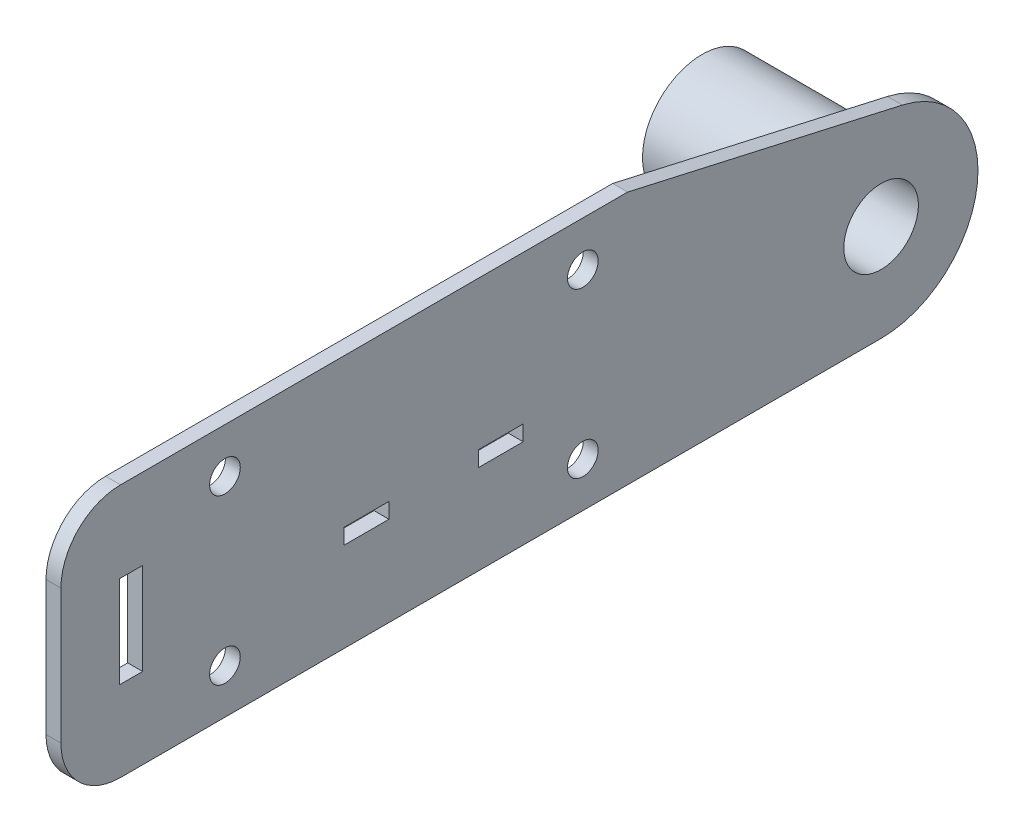
ISO-10303-21;
HEADER;
FILE_DESCRIPTION(('STEP AP214'),'2;1');
FILE_NAME('part.step','',(''),(''),'','','');
FILE_SCHEMA(('AUTOMOTIVE_DESIGN { 1 0 10303 214 1 1 1 1 }'));
ENDSEC;
DATA;
#1=APPLICATION_CONTEXT('core data for automotive mechanical design processes');
#2=APPLICATION_PROTOCOL_DEFINITION('international standard','automotive_design',2000,#1);
#3=PRODUCT_CONTEXT('',#1,'mechanical');
#4=PRODUCT('Part','Part','',(#3));
#5=PRODUCT_RELATED_PRODUCT_CATEGORY('part','',(#4));
#6=PRODUCT_DEFINITION_FORMATION('','',#4);
#7=PRODUCT_DEFINITION_CONTEXT('part definition',#1,'design');
#8=PRODUCT_DEFINITION('design','',#6,#7);
#9=PRODUCT_DEFINITION_SHAPE('','',#8);
#10=(LENGTH_UNIT() NAMED_UNIT(*) SI_UNIT(.MILLI.,.METRE.));
#11=(NAMED_UNIT(*) PLANE_ANGLE_UNIT() SI_UNIT($,.RADIAN.));
#12=(NAMED_UNIT(*) SI_UNIT($,.STERADIAN.) SOLID_ANGLE_UNIT());
#13=UNCERTAINTY_MEASURE_WITH_UNIT(LENGTH_MEASURE(1.E-05),#10,'distance_accuracy_value','');
#14=(GEOMETRIC_REPRESENTATION_CONTEXT(3) GLOBAL_UNCERTAINTY_ASSIGNED_CONTEXT((#13)) GLOBAL_UNIT_ASSIGNED_CONTEXT((#10,
#11,#12)) REPRESENTATION_CONTEXT('',''));
#15=CARTESIAN_POINT('',(0.,0.,0.));
#16=DIRECTION('',(0.,0.,1.));
#17=DIRECTION('',(1.,0.,0.));
#18=AXIS2_PLACEMENT_3D('',#15,#16,#17);
#19=CARTESIAN_POINT('',(3.175,-26.9875,0.));
#20=DIRECTION('',(0.,1.,0.));
#21=DIRECTION('',(0.,0.,1.));
#22=AXIS2_PLACEMENT_3D('',#19,#20,#21);
#23=PLANE('',#22);
#24=DIRECTION('',(0.,0.,-1.));
#25=VECTOR('',#24,1.);
#26=CARTESIAN_POINT('',(0.,-26.9875,0.));
#27=LINE('',#26,#25);
#28=CARTESIAN_POINT('',(0.,-26.9875,60.3249999999999));
#29=VERTEX_POINT('',#28);
#30=CARTESIAN_POINT('',(0.,-26.9875,-101.6));
#31=VERTEX_POINT('',#30);
#32=EDGE_CURVE('E324',#29,#31,#27,.T.);
#33=ORIENTED_EDGE('',*,*,#32,.T.);
#34=DIRECTION('',(-1.,0.,0.));
#35=VECTOR('',#34,1.);
#36=CARTESIAN_POINT('',(3.175,-26.9875,-101.6));
#37=LINE('',#36,#35);
#38=CARTESIAN_POINT('',(3.175,-26.9875,-101.6));
#39=VERTEX_POINT('',#38);
#40=EDGE_CURVE('E338',#39,#31,#37,.T.);
#41=ORIENTED_EDGE('',*,*,#40,.F.);
#42=DIRECTION('',(0.,0.,-1.));
#43=VECTOR('',#42,1.);
#44=CARTESIAN_POINT('',(3.175,-26.9875,0.));
#45=LINE('',#44,#43);
#46=CARTESIAN_POINT('',(3.175,-26.9875,60.3249999999999));
#47=VERTEX_POINT('',#46);
#48=EDGE_CURVE('E301',#47,#39,#45,.T.);
#49=ORIENTED_EDGE('',*,*,#48,.F.);
#50=DIRECTION('',(1.,0.,0.));
#51=VECTOR('',#50,1.);
#52=CARTESIAN_POINT('',(-59.6528341740776,-26.9875,60.3249999999999));
#53=LINE('',#52,#51);
#54=EDGE_CURVE('E265',#29,#47,#53,.T.);
#55=ORIENTED_EDGE('',*,*,#54,.F.);
#56=EDGE_LOOP('',(#33,#41,#49,#55));
#57=FACE_BOUND('',#56,.T.);
#58=ADVANCED_FACE('F38',(#57),#23,.F.);
#59=CARTESIAN_POINT('',(3.175,-6.35,-101.6));
#60=DIRECTION('',(-1.,0.,0.));
#61=DIRECTION('',(0.,0.,1.));
#62=AXIS2_PLACEMENT_3D('',#59,#60,#61);
#63=CYLINDRICAL_SURFACE('',#62,20.6375);
#64=CARTESIAN_POINT('',(0.,-6.35,-101.6));
#65=DIRECTION('',(1.,0.,0.));
#66=DIRECTION('',(0.,0.,-1.));
#67=AXIS2_PLACEMENT_3D('',#64,#65,#66);
#68=CIRCLE('',#67,20.6375);
#69=CARTESIAN_POINT('',(0.,13.7812178866127,-106.143178694673));
#70=VERTEX_POINT('',#69);
#71=EDGE_CURVE('E327',#31,#70,#68,.T.);
#72=ORIENTED_EDGE('',*,*,#71,.T.);
#73=DIRECTION('',(-1.,0.,0.));
#74=VECTOR('',#73,1.);
#75=CARTESIAN_POINT('',(3.175,13.7812178866127,-106.143178694673));
#76=LINE('',#75,#74);
#77=CARTESIAN_POINT('',(3.175,13.7812178866127,-106.143178694673));
#78=VERTEX_POINT('',#77);
#79=EDGE_CURVE('E336',#78,#70,#76,.T.);
#80=ORIENTED_EDGE('',*,*,#79,.F.);
#81=CARTESIAN_POINT('',(3.175,-6.35,-101.6));
#82=DIRECTION('',(1.,0.,0.));
#83=DIRECTION('',(0.,0.,-1.));
#84=AXIS2_PLACEMENT_3D('',#81,#82,#83);
#85=CIRCLE('',#84,20.6375);
#86=EDGE_CURVE('E304',#39,#78,#85,.T.);
#87=ORIENTED_EDGE('',*,*,#86,.F.);
#88=ORIENTED_EDGE('',*,*,#40,.T.);
#89=EDGE_LOOP('',(#72,#80,#87,#88));
#90=FACE_BOUND('',#89,.T.);
#91=ADVANCED_FACE('F377',(#90),#63,.T.);
#92=CARTESIAN_POINT('',(3.175,35.9066765211899,-8.10335711859988));
#93=DIRECTION('',(0.,0.97546785640764,-0.220141911310601));
#94=DIRECTION('',(0.,0.220141911310601,0.97546785640764));
#95=AXIS2_PLACEMENT_3D('',#92,#93,#94);
#96=PLANE('',#95);
#97=DIRECTION('',(0.,-0.220141911310601,-0.97546785640764));
#98=VECTOR('',#97,1.);
#99=CARTESIAN_POINT('',(0.,35.9066765211899,-8.10335711859988));
#100=LINE('',#99,#98);
#101=CARTESIAN_POINT('',(0.,26.9875,-47.625));
#102=VERTEX_POINT('',#101);
#103=EDGE_CURVE('E330',#102,#70,#100,.T.);
#104=ORIENTED_EDGE('',*,*,#103,.F.);
#105=DIRECTION('',(-1.,0.,0.));
#106=VECTOR('',#105,1.);
#107=CARTESIAN_POINT('',(3.175,26.9875,-47.625));
#108=LINE('',#107,#106);
#109=CARTESIAN_POINT('',(3.175,26.9875,-47.625));
#110=VERTEX_POINT('',#109);
#111=EDGE_CURVE('E312',#110,#102,#108,.T.);
#112=ORIENTED_EDGE('',*,*,#111,.F.);
#113=DIRECTION('',(0.,-0.220141911310601,-0.97546785640764));
#114=VECTOR('',#113,1.);
#115=CARTESIAN_POINT('',(3.175,35.9066765211899,-8.10335711859988));
#116=LINE('',#115,#114);
#117=EDGE_CURVE('E306',#110,#78,#116,.T.);
#118=ORIENTED_EDGE('',*,*,#117,.T.);
#119=ORIENTED_EDGE('',*,*,#79,.T.);
#120=EDGE_LOOP('',(#104,#112,#118,#119));
#121=FACE_BOUND('',#120,.T.);
#122=ADVANCED_FACE('F383',(#121),#96,.T.);
#123=CARTESIAN_POINT('',(3.175,26.9875,0.));
#124=DIRECTION('',(0.,1.,0.));
#125=DIRECTION('',(0.,0.,1.));
#126=AXIS2_PLACEMENT_3D('',#123,#124,#125);
#127=PLANE('',#126);
#128=DIRECTION('',(0.,0.,-1.));
#129=VECTOR('',#128,1.);
#130=CARTESIAN_POINT('',(0.,26.9875,0.));
#131=LINE('',#130,#129);
#132=CARTESIAN_POINT('',(0.,26.9875,60.3249999999999));
#133=VERTEX_POINT('',#132);
#134=EDGE_CURVE('E292',#133,#102,#131,.T.);
#135=ORIENTED_EDGE('',*,*,#134,.F.);
#136=DIRECTION('',(1.,0.,0.));
#137=VECTOR('',#136,1.);
#138=CARTESIAN_POINT('',(-59.6528341740776,26.9875,60.3249999999999));
#139=LINE('',#138,#137);
#140=CARTESIAN_POINT('',(3.175,26.9875,60.3249999999999));
#141=VERTEX_POINT('',#140);
#142=EDGE_CURVE('E264',#133,#141,#139,.T.);
#143=ORIENTED_EDGE('',*,*,#142,.T.);
#144=DIRECTION('',(0.,0.,-1.));
#145=VECTOR('',#144,1.);
#146=CARTESIAN_POINT('',(3.175,26.9875,0.));
#147=LINE('',#146,#145);
#148=EDGE_CURVE('E309',#141,#110,#147,.T.);
#149=ORIENTED_EDGE('',*,*,#148,.T.);
#150=ORIENTED_EDGE('',*,*,#111,.T.);
#151=EDGE_LOOP('',(#135,#143,#149,#150));
#152=FACE_BOUND('',#151,.T.);
#153=ADVANCED_FACE('F392',(#152),#127,.T.);
#154=CARTESIAN_POINT('',(3.175,17.4625,38.1));
#155=DIRECTION('',(-1.,0.,0.));
#156=DIRECTION('',(0.,0.,1.));
#157=AXIS2_PLACEMENT_3D('',#154,#155,#156);
#158=CYLINDRICAL_SURFACE('',#157,3.2639);
#159=CARTESIAN_POINT('',(3.175,17.4625,38.1));
#160=DIRECTION('',(1.,0.,0.));
#161=DIRECTION('',(0.,0.,-1.));
#162=AXIS2_PLACEMENT_3D('',#159,#160,#161);
#163=CIRCLE('',#162,3.2639);
#164=CARTESIAN_POINT('',(3.175,17.4625,34.8361));
#165=VERTEX_POINT('',#164);
#166=EDGE_CURVE('E298',#165,#165,#163,.T.);
#167=ORIENTED_EDGE('',*,*,#166,.T.);
#168=EDGE_LOOP('',(#167));
#169=FACE_BOUND('',#168,.T.);
#170=CARTESIAN_POINT('',(0.,17.4625,38.1));
#171=DIRECTION('',(1.,0.,0.));
#172=DIRECTION('',(0.,0.,-1.));
#173=AXIS2_PLACEMENT_3D('',#170,#171,#172);
#174=CIRCLE('',#173,3.2639);
#175=CARTESIAN_POINT('',(0.,17.4625,34.8361));
#176=VERTEX_POINT('',#175);
#177=EDGE_CURVE('E321',#176,#176,#174,.T.);
#178=ORIENTED_EDGE('',*,*,#177,.F.);
#179=EDGE_LOOP('',(#178));
#180=FACE_BOUND('',#179,.T.);
#181=ADVANCED_FACE('F388',(#169,#180),#158,.F.);
#182=CARTESIAN_POINT('',(3.175,17.4625,-38.1));
#183=DIRECTION('',(-1.,0.,0.));
#184=DIRECTION('',(0.,0.,1.));
#185=AXIS2_PLACEMENT_3D('',#182,#183,#184);
#186=CYLINDRICAL_SURFACE('',#185,3.2639);
#187=CARTESIAN_POINT('',(3.175,17.4625,-38.1));
#188=DIRECTION('',(1.,0.,0.));
#189=DIRECTION('',(0.,0.,-1.));
#190=AXIS2_PLACEMENT_3D('',#187,#188,#189);
#191=CIRCLE('',#190,3.2639);
#192=CARTESIAN_POINT('',(3.175,17.4625,-41.3639));
#193=VERTEX_POINT('',#192);
#194=EDGE_CURVE('E295',#193,#193,#191,.T.);
#195=ORIENTED_EDGE('',*,*,#194,.T.);
#196=EDGE_LOOP('',(#195));
#197=FACE_BOUND('',#196,.T.);
#198=CARTESIAN_POINT('',(0.,17.4625,-38.1));
#199=DIRECTION('',(1.,0.,0.));
#200=DIRECTION('',(0.,0.,-1.));
#201=AXIS2_PLACEMENT_3D('',#198,#199,#200);
#202=CIRCLE('',#201,3.2639);
#203=CARTESIAN_POINT('',(0.,17.4625,-41.3639));
#204=VERTEX_POINT('',#203);
#205=EDGE_CURVE('E318',#204,#204,#202,.T.);
#206=ORIENTED_EDGE('',*,*,#205,.F.);
#207=EDGE_LOOP('',(#206));
#208=FACE_BOUND('',#207,.T.);
#209=ADVANCED_FACE('F391',(#197,#208),#186,.F.);
#210=CARTESIAN_POINT('',(3.175,-17.4625,38.1));
#211=DIRECTION('',(-1.,0.,0.));
#212=DIRECTION('',(0.,0.,1.));
#213=AXIS2_PLACEMENT_3D('',#210,#211,#212);
#214=CYLINDRICAL_SURFACE('',#213,3.2639);
#215=CARTESIAN_POINT('',(3.175,-17.4625,38.1));
#216=DIRECTION('',(1.,0.,0.));
#217=DIRECTION('',(0.,0.,-1.));
#218=AXIS2_PLACEMENT_3D('',#215,#216,#217);
#219=CIRCLE('',#218,3.2639);
#220=CARTESIAN_POINT('',(3.175,-17.4625,34.8361));
#221=VERTEX_POINT('',#220);
#222=EDGE_CURVE('E291',#221,#221,#219,.T.);
#223=ORIENTED_EDGE('',*,*,#222,.T.);
#224=EDGE_LOOP('',(#223));
#225=FACE_BOUND('',#224,.T.);
#226=CARTESIAN_POINT('',(0.,-17.4625,38.1));
#227=DIRECTION('',(1.,0.,0.));
#228=DIRECTION('',(0.,0.,-1.));
#229=AXIS2_PLACEMENT_3D('',#226,#227,#228);
#230=CIRCLE('',#229,3.2639);
#231=CARTESIAN_POINT('',(0.,-17.4625,34.8361));
#232=VERTEX_POINT('',#231);
#233=EDGE_CURVE('E315',#232,#232,#230,.T.);
#234=ORIENTED_EDGE('',*,*,#233,.F.);
#235=EDGE_LOOP('',(#234));
#236=FACE_BOUND('',#235,.T.);
#237=ADVANCED_FACE('F395',(#225,#236),#214,.F.);
#238=CARTESIAN_POINT('',(3.175,-17.4625,-38.1));
#239=DIRECTION('',(-1.,0.,0.));
#240=DIRECTION('',(0.,0.,1.));
#241=AXIS2_PLACEMENT_3D('',#238,#239,#240);
#242=CYLINDRICAL_SURFACE('',#241,3.2639);
#243=CARTESIAN_POINT('',(3.175,-17.4625,-38.1));
#244=DIRECTION('',(1.,0.,0.));
#245=DIRECTION('',(0.,0.,-1.));
#246=AXIS2_PLACEMENT_3D('',#243,#244,#245);
#247=CIRCLE('',#246,3.2639);
#248=CARTESIAN_POINT('',(3.175,-17.4625,-41.3639));
#249=VERTEX_POINT('',#248);
#250=EDGE_CURVE('E288',#249,#249,#247,.T.);
#251=ORIENTED_EDGE('',*,*,#250,.T.);
#252=EDGE_LOOP('',(#251));
#253=FACE_BOUND('',#252,.T.);
#254=CARTESIAN_POINT('',(0.,-17.4625,-38.1));
#255=DIRECTION('',(1.,0.,0.));
#256=DIRECTION('',(0.,0.,-1.));
#257=AXIS2_PLACEMENT_3D('',#254,#255,#256);
#258=CIRCLE('',#257,3.2639);
#259=CARTESIAN_POINT('',(0.,-17.4625,-41.3639));
#260=VERTEX_POINT('',#259);
#261=EDGE_CURVE('E287',#260,#260,#258,.T.);
#262=ORIENTED_EDGE('',*,*,#261,.F.);
#263=EDGE_LOOP('',(#262));
#264=FACE_BOUND('',#263,.T.);
#265=ADVANCED_FACE('F40',(#253,#264),#242,.F.);
#266=CARTESIAN_POINT('',(3.175,0.,0.));
#267=DIRECTION('',(1.,0.,0.));
#268=DIRECTION('',(0.,0.,-1.));
#269=AXIS2_PLACEMENT_3D('',#266,#267,#268);
#270=PLANE('',#269);
#271=DIRECTION('',(0.,-1.,0.));
#272=VECTOR('',#271,1.);
#273=CARTESIAN_POINT('',(3.175,-4.6355,12.7));
#274=LINE('',#273,#272);
#275=CARTESIAN_POINT('',(3.175,-4.6355,12.7));
#276=VERTEX_POINT('',#275);
#277=CARTESIAN_POINT('',(3.175,-7.9375,12.7));
#278=VERTEX_POINT('',#277);
#279=EDGE_CURVE('E53',#276,#278,#274,.T.);
#280=ORIENTED_EDGE('',*,*,#279,.F.);
#281=DIRECTION('',(0.,0.,1.));
#282=VECTOR('',#281,1.);
#283=CARTESIAN_POINT('',(3.175,-4.6355,12.7));
#284=LINE('',#283,#282);
#285=CARTESIAN_POINT('',(3.175,-4.6355,3.175));
#286=VERTEX_POINT('',#285);
#287=EDGE_CURVE('E188',#286,#276,#284,.T.);
#288=ORIENTED_EDGE('',*,*,#287,.F.);
#289=DIRECTION('',(0.,1.,0.));
#290=VECTOR('',#289,1.);
#291=CARTESIAN_POINT('',(3.175,-4.6355,3.175));
#292=LINE('',#291,#290);
#293=CARTESIAN_POINT('',(3.175,-7.9375,3.175));
#294=VERTEX_POINT('',#293);
#295=EDGE_CURVE('E172',#294,#286,#292,.T.);
#296=ORIENTED_EDGE('',*,*,#295,.F.);
#297=DIRECTION('',(0.,0.,-1.));
#298=VECTOR('',#297,1.);
#299=CARTESIAN_POINT('',(3.175,-7.9375,12.7));
#300=LINE('',#299,#298);
#301=EDGE_CURVE('E181',#278,#294,#300,.T.);
#302=ORIENTED_EDGE('',*,*,#301,.F.);
#303=EDGE_LOOP('',(#280,#288,#296,#302));
#304=FACE_BOUND('',#303,.T.);
#305=DIRECTION('',(0.,-1.,0.));
#306=VECTOR('',#305,1.);
#307=CARTESIAN_POINT('',(3.175,-4.6355,-15.875));
#308=LINE('',#307,#306);
#309=CARTESIAN_POINT('',(3.175,-4.6355,-15.875));
#310=VERTEX_POINT('',#309);
#311=CARTESIAN_POINT('',(3.175,-7.9375,-15.875));
#312=VERTEX_POINT('',#311);
#313=EDGE_CURVE('E195',#310,#312,#308,.T.);
#314=ORIENTED_EDGE('',*,*,#313,.F.);
#315=DIRECTION('',(0.,0.,1.));
#316=VECTOR('',#315,1.);
#317=CARTESIAN_POINT('',(3.175,-4.6355,-15.875));
#318=LINE('',#317,#316);
#319=CARTESIAN_POINT('',(3.175,-4.6355,-25.4));
#320=VERTEX_POINT('',#319);
#321=EDGE_CURVE('E205',#320,#310,#318,.T.);
#322=ORIENTED_EDGE('',*,*,#321,.F.);
#323=DIRECTION('',(0.,1.,0.));
#324=VECTOR('',#323,1.);
#325=CARTESIAN_POINT('',(3.175,-4.6355,-25.4));
#326=LINE('',#325,#324);
#327=CARTESIAN_POINT('',(3.175,-7.9375,-25.4));
#328=VERTEX_POINT('',#327);
#329=EDGE_CURVE('E202',#328,#320,#326,.T.);
#330=ORIENTED_EDGE('',*,*,#329,.F.);
#331=DIRECTION('',(0.,0.,-1.));
#332=VECTOR('',#331,1.);
#333=CARTESIAN_POINT('',(3.175,-7.9375,-15.875));
#334=LINE('',#333,#332);
#335=EDGE_CURVE('E199',#312,#328,#334,.T.);
#336=ORIENTED_EDGE('',*,*,#335,.F.);
#337=EDGE_LOOP('',(#314,#322,#330,#336));
#338=FACE_BOUND('',#337,.T.);
#339=ORIENTED_EDGE('',*,*,#250,.F.);
#340=EDGE_LOOP('',(#339));
#341=FACE_BOUND('',#340,.T.);
#342=ORIENTED_EDGE('',*,*,#222,.F.);
#343=EDGE_LOOP('',(#342));
#344=FACE_BOUND('',#343,.T.);
#345=ORIENTED_EDGE('',*,*,#194,.F.);
#346=EDGE_LOOP('',(#345));
#347=FACE_BOUND('',#346,.T.);
#348=ORIENTED_EDGE('',*,*,#166,.F.);
#349=EDGE_LOOP('',(#348));
#350=FACE_BOUND('',#349,.T.);
#351=ORIENTED_EDGE('',*,*,#48,.T.);
#352=ORIENTED_EDGE('',*,*,#86,.T.);
#353=ORIENTED_EDGE('',*,*,#117,.F.);
#354=ORIENTED_EDGE('',*,*,#148,.F.);
#355=CARTESIAN_POINT('',(3.175,14.2875,60.325));
#356=DIRECTION('',(1.,0.,0.));
#357=DIRECTION('',(0.,0.,-1.));
#358=AXIS2_PLACEMENT_3D('',#355,#356,#357);
#359=CIRCLE('',#358,12.7);
#360=CARTESIAN_POINT('',(3.175,14.2874999999999,73.025));
#361=VERTEX_POINT('',#360);
#362=EDGE_CURVE('E250',#141,#361,#359,.T.);
#363=ORIENTED_EDGE('',*,*,#362,.T.);
#364=DIRECTION('',(0.,-1.,0.));
#365=VECTOR('',#364,1.);
#366=CARTESIAN_POINT('',(3.175,14.2874999999999,73.025));
#367=LINE('',#366,#365);
#368=CARTESIAN_POINT('',(3.175,-14.2874999999999,73.025));
#369=VERTEX_POINT('',#368);
#370=EDGE_CURVE('E258',#361,#369,#367,.T.);
#371=ORIENTED_EDGE('',*,*,#370,.T.);
#372=CARTESIAN_POINT('',(3.175,-14.2875,60.325));
#373=DIRECTION('',(1.,0.,0.));
#374=DIRECTION('',(0.,0.,1.));
#375=AXIS2_PLACEMENT_3D('',#372,#373,#374);
#376=CIRCLE('',#375,12.7);
#377=EDGE_CURVE('E261',#369,#47,#376,.T.);
#378=ORIENTED_EDGE('',*,*,#377,.T.);
#379=EDGE_LOOP('',(#351,#352,#353,#354,#363,#371,#378));
#380=FACE_BOUND('',#379,.T.);
#381=CARTESIAN_POINT('',(3.175,-6.35,-101.6));
#382=DIRECTION('',(-1.,0.,0.));
#383=DIRECTION('',(0.,0.,1.));
#384=AXIS2_PLACEMENT_3D('',#381,#382,#383);
#385=CIRCLE('',#384,7.93749999999999);
#386=CARTESIAN_POINT('',(3.175,-6.35,-93.6625));
#387=VERTEX_POINT('',#386);
#388=EDGE_CURVE('E281',#387,#387,#385,.T.);
#389=ORIENTED_EDGE('',*,*,#388,.T.);
#390=EDGE_LOOP('',(#389));
#391=FACE_BOUND('',#390,.T.);
#392=DIRECTION('',(0.,0.,-1.));
#393=VECTOR('',#392,1.);
#394=CARTESIAN_POINT('',(3.175,-9.77900000000001,60.579));
#395=LINE('',#394,#393);
#396=CARTESIAN_POINT('',(3.175,-9.77900000000001,60.579));
#397=VERTEX_POINT('',#396);
#398=CARTESIAN_POINT('',(3.175,-9.77900000000001,55.626));
#399=VERTEX_POINT('',#398);
#400=EDGE_CURVE('E238',#397,#399,#395,.T.);
#401=ORIENTED_EDGE('',*,*,#400,.F.);
#402=DIRECTION('',(0.,-1.,0.));
#403=VECTOR('',#402,1.);
#404=CARTESIAN_POINT('',(3.175,9.77899999999999,60.579));
#405=LINE('',#404,#403);
#406=CARTESIAN_POINT('',(3.175,9.77899999999999,60.579));
#407=VERTEX_POINT('',#406);
#408=EDGE_CURVE('E211',#407,#397,#405,.T.);
#409=ORIENTED_EDGE('',*,*,#408,.F.);
#410=DIRECTION('',(0.,0.,1.));
#411=VECTOR('',#410,1.);
#412=CARTESIAN_POINT('',(3.175,9.77899999999999,60.579));
#413=LINE('',#412,#411);
#414=CARTESIAN_POINT('',(3.175,9.77899999999999,55.626));
#415=VERTEX_POINT('',#414);
#416=EDGE_CURVE('E244',#415,#407,#413,.T.);
#417=ORIENTED_EDGE('',*,*,#416,.F.);
#418=DIRECTION('',(0.,1.,0.));
#419=VECTOR('',#418,1.);
#420=CARTESIAN_POINT('',(3.175,9.77899999999999,55.626));
#421=LINE('',#420,#419);
#422=EDGE_CURVE('E241',#399,#415,#421,.T.);
#423=ORIENTED_EDGE('',*,*,#422,.F.);
#424=EDGE_LOOP('',(#401,#409,#417,#423));
#425=FACE_BOUND('',#424,.T.);
#426=ADVANCED_FACE('F185',(#304,#338,#341,#344,#347,#350,#380,#391,#425),#270,.T.);
#427=CARTESIAN_POINT('',(0.,0.,0.));
#428=DIRECTION('',(1.,0.,0.));
#429=DIRECTION('',(0.,0.,-1.));
#430=AXIS2_PLACEMENT_3D('',#427,#428,#429);
#431=PLANE('',#430);
#432=DIRECTION('',(0.,0.,1.));
#433=VECTOR('',#432,1.);
#434=CARTESIAN_POINT('',(0.,-4.6355,0.));
#435=LINE('',#434,#433);
#436=CARTESIAN_POINT('',(0.,-4.6355,3.175));
#437=VERTEX_POINT('',#436);
#438=CARTESIAN_POINT('',(0.,-4.6355,12.7));
#439=VERTEX_POINT('',#438);
#440=EDGE_CURVE('E46',#437,#439,#435,.T.);
#441=ORIENTED_EDGE('',*,*,#440,.T.);
#442=DIRECTION('',(0.,-1.,0.));
#443=VECTOR('',#442,1.);
#444=CARTESIAN_POINT('',(0.,0.,12.7));
#445=LINE('',#444,#443);
#446=CARTESIAN_POINT('',(0.,-7.9375,12.7));
#447=VERTEX_POINT('',#446);
#448=EDGE_CURVE('E12',#439,#447,#445,.T.);
#449=ORIENTED_EDGE('',*,*,#448,.T.);
#450=DIRECTION('',(0.,0.,-1.));
#451=VECTOR('',#450,1.);
#452=CARTESIAN_POINT('',(0.,-7.9375,0.));
#453=LINE('',#452,#451);
#454=CARTESIAN_POINT('',(0.,-7.9375,3.175));
#455=VERTEX_POINT('',#454);
#456=EDGE_CURVE('E353',#447,#455,#453,.T.);
#457=ORIENTED_EDGE('',*,*,#456,.T.);
#458=DIRECTION('',(0.,1.,0.));
#459=VECTOR('',#458,1.);
#460=CARTESIAN_POINT('',(0.,0.,3.175));
#461=LINE('',#460,#459);
#462=EDGE_CURVE('E175',#455,#437,#461,.T.);
#463=ORIENTED_EDGE('',*,*,#462,.T.);
#464=EDGE_LOOP('',(#441,#449,#457,#463));
#465=FACE_BOUND('',#464,.T.);
#466=DIRECTION('',(0.,0.,1.));
#467=VECTOR('',#466,1.);
#468=CARTESIAN_POINT('',(0.,-4.6355,0.));
#469=LINE('',#468,#467);
#470=CARTESIAN_POINT('',(0.,-4.6355,-25.4));
#471=VERTEX_POINT('',#470);
#472=CARTESIAN_POINT('',(0.,-4.6355,-15.875));
#473=VERTEX_POINT('',#472);
#474=EDGE_CURVE('E347',#471,#473,#469,.T.);
#475=ORIENTED_EDGE('',*,*,#474,.T.);
#476=DIRECTION('',(0.,-1.,0.));
#477=VECTOR('',#476,1.);
#478=CARTESIAN_POINT('',(0.,0.,-15.875));
#479=LINE('',#478,#477);
#480=CARTESIAN_POINT('',(0.,-7.9375,-15.875));
#481=VERTEX_POINT('',#480);
#482=EDGE_CURVE('E350',#473,#481,#479,.T.);
#483=ORIENTED_EDGE('',*,*,#482,.T.);
#484=DIRECTION('',(0.,0.,-1.));
#485=VECTOR('',#484,1.);
#486=CARTESIAN_POINT('',(0.,-7.9375,0.));
#487=LINE('',#486,#485);
#488=CARTESIAN_POINT('',(0.,-7.9375,-25.4));
#489=VERTEX_POINT('',#488);
#490=EDGE_CURVE('E341',#481,#489,#487,.T.);
#491=ORIENTED_EDGE('',*,*,#490,.T.);
#492=DIRECTION('',(0.,1.,0.));
#493=VECTOR('',#492,1.);
#494=CARTESIAN_POINT('',(0.,0.,-25.4));
#495=LINE('',#494,#493);
#496=EDGE_CURVE('E344',#489,#471,#495,.T.);
#497=ORIENTED_EDGE('',*,*,#496,.T.);
#498=EDGE_LOOP('',(#475,#483,#491,#497));
#499=FACE_BOUND('',#498,.T.);
#500=ORIENTED_EDGE('',*,*,#261,.T.);
#501=EDGE_LOOP('',(#500));
#502=FACE_BOUND('',#501,.T.);
#503=ORIENTED_EDGE('',*,*,#233,.T.);
#504=EDGE_LOOP('',(#503));
#505=FACE_BOUND('',#504,.T.);
#506=ORIENTED_EDGE('',*,*,#205,.T.);
#507=EDGE_LOOP('',(#506));
#508=FACE_BOUND('',#507,.T.);
#509=ORIENTED_EDGE('',*,*,#177,.T.);
#510=EDGE_LOOP('',(#509));
#511=FACE_BOUND('',#510,.T.);
#512=ORIENTED_EDGE('',*,*,#32,.F.);
#513=CARTESIAN_POINT('',(0.,-14.2875,60.325));
#514=DIRECTION('',(1.,0.,0.));
#515=DIRECTION('',(0.,0.,-1.));
#516=AXIS2_PLACEMENT_3D('',#513,#514,#515);
#517=CIRCLE('',#516,12.7);
#518=CARTESIAN_POINT('',(0.,-14.2874999999999,73.025));
#519=VERTEX_POINT('',#518);
#520=EDGE_CURVE('E228',#29,#519,#517,.F.);
#521=ORIENTED_EDGE('',*,*,#520,.T.);
#522=DIRECTION('',(0.,1.,0.));
#523=VECTOR('',#522,1.);
#524=CARTESIAN_POINT('',(0.,14.2874999999999,73.025));
#525=LINE('',#524,#523);
#526=CARTESIAN_POINT('',(0.,14.2874999999999,73.025));
#527=VERTEX_POINT('',#526);
#528=EDGE_CURVE('E232',#519,#527,#525,.T.);
#529=ORIENTED_EDGE('',*,*,#528,.T.);
#530=CARTESIAN_POINT('',(0.,14.2875,60.325));
#531=DIRECTION('',(1.,0.,0.));
#532=DIRECTION('',(0.,0.,-1.));
#533=AXIS2_PLACEMENT_3D('',#530,#531,#532);
#534=CIRCLE('',#533,12.7);
#535=EDGE_CURVE('E229',#527,#133,#534,.F.);
#536=ORIENTED_EDGE('',*,*,#535,.T.);
#537=ORIENTED_EDGE('',*,*,#134,.T.);
#538=ORIENTED_EDGE('',*,*,#103,.T.);
#539=ORIENTED_EDGE('',*,*,#71,.F.);
#540=EDGE_LOOP('',(#512,#521,#529,#536,#537,#538,#539));
#541=FACE_BOUND('',#540,.T.);
#542=CARTESIAN_POINT('',(0.,-6.35,-101.6));
#543=DIRECTION('',(1.,0.,0.));
#544=DIRECTION('',(0.,0.,-1.));
#545=AXIS2_PLACEMENT_3D('',#542,#543,#544);
#546=CIRCLE('',#545,12.7);
#547=CARTESIAN_POINT('',(0.,-6.35,-114.3));
#548=VERTEX_POINT('',#547);
#549=EDGE_CURVE('E284',#548,#548,#546,.T.);
#550=ORIENTED_EDGE('',*,*,#549,.T.);
#551=EDGE_LOOP('',(#550));
#552=FACE_BOUND('',#551,.T.);
#553=DIRECTION('',(0.,0.,1.));
#554=VECTOR('',#553,1.);
#555=CARTESIAN_POINT('',(0.,-9.77900000000001,60.579));
#556=LINE('',#555,#554);
#557=CARTESIAN_POINT('',(0.,-9.77900000000001,55.626));
#558=VERTEX_POINT('',#557);
#559=CARTESIAN_POINT('',(0.,-9.77900000000001,60.579));
#560=VERTEX_POINT('',#559);
#561=EDGE_CURVE('E233',#558,#560,#556,.T.);
#562=ORIENTED_EDGE('',*,*,#561,.F.);
#563=DIRECTION('',(0.,-1.,0.));
#564=VECTOR('',#563,1.);
#565=CARTESIAN_POINT('',(0.,9.77899999999999,55.626));
#566=LINE('',#565,#564);
#567=CARTESIAN_POINT('',(0.,9.77899999999999,55.626));
#568=VERTEX_POINT('',#567);
#569=EDGE_CURVE('E218',#568,#558,#566,.T.);
#570=ORIENTED_EDGE('',*,*,#569,.F.);
#571=DIRECTION('',(0.,0.,-1.));
#572=VECTOR('',#571,1.);
#573=CARTESIAN_POINT('',(0.,9.77899999999999,60.579));
#574=LINE('',#573,#572);
#575=CARTESIAN_POINT('',(0.,9.77899999999999,60.579));
#576=VERTEX_POINT('',#575);
#577=EDGE_CURVE('E222',#576,#568,#574,.T.);
#578=ORIENTED_EDGE('',*,*,#577,.F.);
#579=DIRECTION('',(0.,1.,0.));
#580=VECTOR('',#579,1.);
#581=CARTESIAN_POINT('',(0.,9.77899999999999,60.579));
#582=LINE('',#581,#580);
#583=EDGE_CURVE('E225',#560,#576,#582,.T.);
#584=ORIENTED_EDGE('',*,*,#583,.F.);
#585=EDGE_LOOP('',(#562,#570,#578,#584));
#586=FACE_BOUND('',#585,.T.);
#587=ADVANCED_FACE('F357',(#465,#499,#502,#505,#508,#511,#541,#552,#586),#431,.F.);
#588=CARTESIAN_POINT('',(3.175,-6.35,-101.6));
#589=DIRECTION('',(-1.,0.,0.));
#590=DIRECTION('',(0.,0.,1.));
#591=AXIS2_PLACEMENT_3D('',#588,#589,#590);
#592=CYLINDRICAL_SURFACE('',#591,12.7);
#593=CARTESIAN_POINT('',(-34.925,-6.35,-101.6));
#594=DIRECTION('',(-1.,0.,0.));
#595=DIRECTION('',(0.,0.,1.));
#596=AXIS2_PLACEMENT_3D('',#593,#594,#595);
#597=CIRCLE('',#596,12.7);
#598=CARTESIAN_POINT('',(-34.925,-6.35,-88.9));
#599=VERTEX_POINT('',#598);
#600=EDGE_CURVE('E278',#599,#599,#597,.T.);
#601=ORIENTED_EDGE('',*,*,#600,.F.);
#602=EDGE_LOOP('',(#601));
#603=FACE_BOUND('',#602,.T.);
#604=ORIENTED_EDGE('',*,*,#549,.F.);
#605=EDGE_LOOP('',(#604));
#606=FACE_BOUND('',#605,.T.);
#607=ADVANCED_FACE('F409',(#603,#606),#592,.T.);
#608=CARTESIAN_POINT('',(3.175,-6.35,-101.6));
#609=DIRECTION('',(-1.,0.,0.));
#610=DIRECTION('',(0.,0.,1.));
#611=AXIS2_PLACEMENT_3D('',#608,#609,#610);
#612=CYLINDRICAL_SURFACE('',#611,7.93749999999999);
#613=ORIENTED_EDGE('',*,*,#388,.F.);
#614=EDGE_LOOP('',(#613));
#615=FACE_BOUND('',#614,.T.);
#616=CARTESIAN_POINT('',(-34.925,-6.35,-101.6));
#617=DIRECTION('',(-1.,0.,0.));
#618=DIRECTION('',(0.,0.,1.));
#619=AXIS2_PLACEMENT_3D('',#616,#617,#618);
#620=CIRCLE('',#619,7.93749999999999);
#621=CARTESIAN_POINT('',(-34.925,-6.35,-93.6625));
#622=VERTEX_POINT('',#621);
#623=EDGE_CURVE('E221',#622,#622,#620,.T.);
#624=ORIENTED_EDGE('',*,*,#623,.T.);
#625=EDGE_LOOP('',(#624));
#626=FACE_BOUND('',#625,.T.);
#627=ADVANCED_FACE('F465',(#615,#626),#612,.F.);
#628=CARTESIAN_POINT('',(-34.925,-6.35,-101.6));
#629=DIRECTION('',(-1.,0.,0.));
#630=DIRECTION('',(0.,0.,1.));
#631=AXIS2_PLACEMENT_3D('',#628,#629,#630);
#632=PLANE('',#631);
#633=ORIENTED_EDGE('',*,*,#600,.T.);
#634=EDGE_LOOP('',(#633));
#635=FACE_BOUND('',#634,.T.);
#636=ORIENTED_EDGE('',*,*,#623,.F.);
#637=EDGE_LOOP('',(#636));
#638=FACE_BOUND('',#637,.T.);
#639=ADVANCED_FACE('F461',(#635,#638),#632,.T.);
#640=CARTESIAN_POINT('',(-59.6528341740776,14.2875,60.325));
#641=DIRECTION('',(1.,0.,0.));
#642=DIRECTION('',(0.,0.,-1.));
#643=AXIS2_PLACEMENT_3D('',#640,#641,#642);
#644=CYLINDRICAL_SURFACE('',#643,12.7);
#645=ORIENTED_EDGE('',*,*,#535,.F.);
#646=DIRECTION('',(1.,0.,0.));
#647=VECTOR('',#646,1.);
#648=CARTESIAN_POINT('',(-59.6528341740776,14.2874999999999,73.025));
#649=LINE('',#648,#647);
#650=EDGE_CURVE('E270',#527,#361,#649,.T.);
#651=ORIENTED_EDGE('',*,*,#650,.T.);
#652=ORIENTED_EDGE('',*,*,#362,.F.);
#653=ORIENTED_EDGE('',*,*,#142,.F.);
#654=EDGE_LOOP('',(#645,#651,#652,#653));
#655=FACE_BOUND('',#654,.T.);
#656=ADVANCED_FACE('F457',(#655),#644,.T.);
#657=CARTESIAN_POINT('',(-59.6528341740776,14.2874999999999,73.025));
#658=DIRECTION('',(0.,0.,1.));
#659=DIRECTION('',(1.,0.,0.));
#660=AXIS2_PLACEMENT_3D('',#657,#658,#659);
#661=PLANE('',#660);
#662=ORIENTED_EDGE('',*,*,#528,.F.);
#663=DIRECTION('',(1.,0.,0.));
#664=VECTOR('',#663,1.);
#665=CARTESIAN_POINT('',(-59.6528341740776,-14.2874999999999,73.025));
#666=LINE('',#665,#664);
#667=EDGE_CURVE('E268',#519,#369,#666,.T.);
#668=ORIENTED_EDGE('',*,*,#667,.T.);
#669=ORIENTED_EDGE('',*,*,#370,.F.);
#670=ORIENTED_EDGE('',*,*,#650,.F.);
#671=EDGE_LOOP('',(#662,#668,#669,#670));
#672=FACE_BOUND('',#671,.T.);
#673=ADVANCED_FACE('F453',(#672),#661,.T.);
#674=CARTESIAN_POINT('',(-59.6528341740776,-14.2875,60.325));
#675=DIRECTION('',(1.,0.,0.));
#676=DIRECTION('',(0.,0.,-1.));
#677=AXIS2_PLACEMENT_3D('',#674,#675,#676);
#678=CYLINDRICAL_SURFACE('',#677,12.7);
#679=ORIENTED_EDGE('',*,*,#520,.F.);
#680=ORIENTED_EDGE('',*,*,#54,.T.);
#681=ORIENTED_EDGE('',*,*,#377,.F.);
#682=ORIENTED_EDGE('',*,*,#667,.F.);
#683=EDGE_LOOP('',(#679,#680,#681,#682));
#684=FACE_BOUND('',#683,.T.);
#685=ADVANCED_FACE('F450',(#684),#678,.T.);
#686=CARTESIAN_POINT('',(-59.6528341740776,-9.77900000000001,60.579));
#687=DIRECTION('',(0.,-1.,0.));
#688=DIRECTION('',(0.,0.,-1.));
#689=AXIS2_PLACEMENT_3D('',#686,#687,#688);
#690=PLANE('',#689);
#691=DIRECTION('',(1.,0.,0.));
#692=VECTOR('',#691,1.);
#693=CARTESIAN_POINT('',(-59.6528341740776,-9.77900000000001,55.626));
#694=LINE('',#693,#692);
#695=EDGE_CURVE('E253',#558,#399,#694,.T.);
#696=ORIENTED_EDGE('',*,*,#695,.F.);
#697=ORIENTED_EDGE('',*,*,#561,.T.);
#698=DIRECTION('',(1.,0.,0.));
#699=VECTOR('',#698,1.);
#700=CARTESIAN_POINT('',(-59.6528341740776,-9.77900000000001,60.579));
#701=LINE('',#700,#699);
#702=EDGE_CURVE('E247',#560,#397,#701,.T.);
#703=ORIENTED_EDGE('',*,*,#702,.T.);
#704=ORIENTED_EDGE('',*,*,#400,.T.);
#705=EDGE_LOOP('',(#696,#697,#703,#704));
#706=FACE_BOUND('',#705,.T.);
#707=ADVANCED_FACE('F425',(#706),#690,.F.);
#708=CARTESIAN_POINT('',(-59.6528341740776,9.77899999999999,55.626));
#709=DIRECTION('',(0.,0.,-1.));
#710=DIRECTION('',(0.,1.,0.));
#711=AXIS2_PLACEMENT_3D('',#708,#709,#710);
#712=PLANE('',#711);
#713=DIRECTION('',(1.,0.,0.));
#714=VECTOR('',#713,1.);
#715=CARTESIAN_POINT('',(-59.6528341740776,9.77899999999999,55.626));
#716=LINE('',#715,#714);
#717=EDGE_CURVE('E251',#568,#415,#716,.T.);
#718=ORIENTED_EDGE('',*,*,#717,.F.);
#719=ORIENTED_EDGE('',*,*,#569,.T.);
#720=ORIENTED_EDGE('',*,*,#695,.T.);
#721=ORIENTED_EDGE('',*,*,#422,.T.);
#722=EDGE_LOOP('',(#718,#719,#720,#721));
#723=FACE_BOUND('',#722,.T.);
#724=ADVANCED_FACE('F424',(#723),#712,.F.);
#725=CARTESIAN_POINT('',(-59.6528341740776,9.77899999999999,60.579));
#726=DIRECTION('',(0.,1.,0.));
#727=DIRECTION('',(0.,0.,1.));
#728=AXIS2_PLACEMENT_3D('',#725,#726,#727);
#729=PLANE('',#728);
#730=DIRECTION('',(1.,0.,0.));
#731=VECTOR('',#730,1.);
#732=CARTESIAN_POINT('',(-59.6528341740776,9.77899999999999,60.579));
#733=LINE('',#732,#731);
#734=EDGE_CURVE('E248',#576,#407,#733,.T.);
#735=ORIENTED_EDGE('',*,*,#734,.F.);
#736=ORIENTED_EDGE('',*,*,#577,.T.);
#737=ORIENTED_EDGE('',*,*,#717,.T.);
#738=ORIENTED_EDGE('',*,*,#416,.T.);
#739=EDGE_LOOP('',(#735,#736,#737,#738));
#740=FACE_BOUND('',#739,.T.);
#741=ADVANCED_FACE('F433',(#740),#729,.F.);
#742=CARTESIAN_POINT('',(-59.6528341740776,9.77899999999999,60.579));
#743=DIRECTION('',(0.,0.,1.));
#744=DIRECTION('',(0.,-1.,0.));
#745=AXIS2_PLACEMENT_3D('',#742,#743,#744);
#746=PLANE('',#745);
#747=ORIENTED_EDGE('',*,*,#702,.F.);
#748=ORIENTED_EDGE('',*,*,#583,.T.);
#749=ORIENTED_EDGE('',*,*,#734,.T.);
#750=ORIENTED_EDGE('',*,*,#408,.T.);
#751=EDGE_LOOP('',(#747,#748,#749,#750));
#752=FACE_BOUND('',#751,.T.);
#753=ADVANCED_FACE('F435',(#752),#746,.F.);
#754=CARTESIAN_POINT('',(-34.925,-4.6355,-15.875));
#755=DIRECTION('',(0.,0.,1.));
#756=DIRECTION('',(1.,0.,0.));
#757=AXIS2_PLACEMENT_3D('',#754,#755,#756);
#758=PLANE('',#757);
#759=DIRECTION('',(1.,0.,0.));
#760=VECTOR('',#759,1.);
#761=CARTESIAN_POINT('',(-34.925,-4.6355,-15.875));
#762=LINE('',#761,#760);
#763=EDGE_CURVE('E209',#473,#310,#762,.T.);
#764=ORIENTED_EDGE('',*,*,#763,.T.);
#765=ORIENTED_EDGE('',*,*,#313,.T.);
#766=DIRECTION('',(1.,0.,0.));
#767=VECTOR('',#766,1.);
#768=CARTESIAN_POINT('',(-34.925,-7.9375,-15.875));
#769=LINE('',#768,#767);
#770=EDGE_CURVE('E208',#481,#312,#769,.T.);
#771=ORIENTED_EDGE('',*,*,#770,.F.);
#772=ORIENTED_EDGE('',*,*,#482,.F.);
#773=EDGE_LOOP('',(#764,#765,#771,#772));
#774=FACE_BOUND('',#773,.T.);
#775=ADVANCED_FACE('F437',(#774),#758,.F.);
#776=CARTESIAN_POINT('',(-34.925,-4.6355,-15.875));
#777=DIRECTION('',(0.,1.,0.));
#778=DIRECTION('',(0.,0.,1.));
#779=AXIS2_PLACEMENT_3D('',#776,#777,#778);
#780=PLANE('',#779);
#781=DIRECTION('',(1.,0.,0.));
#782=VECTOR('',#781,1.);
#783=CARTESIAN_POINT('',(-34.925,-4.6355,-25.4));
#784=LINE('',#783,#782);
#785=EDGE_CURVE('E212',#471,#320,#784,.T.);
#786=ORIENTED_EDGE('',*,*,#785,.T.);
#787=ORIENTED_EDGE('',*,*,#321,.T.);
#788=ORIENTED_EDGE('',*,*,#763,.F.);
#789=ORIENTED_EDGE('',*,*,#474,.F.);
#790=EDGE_LOOP('',(#786,#787,#788,#789));
#791=FACE_BOUND('',#790,.T.);
#792=ADVANCED_FACE('F443',(#791),#780,.F.);
#793=CARTESIAN_POINT('',(-34.925,-4.6355,-25.4));
#794=DIRECTION('',(0.,0.,-1.));
#795=DIRECTION('',(0.,1.,0.));
#796=AXIS2_PLACEMENT_3D('',#793,#794,#795);
#797=PLANE('',#796);
#798=DIRECTION('',(1.,0.,0.));
#799=VECTOR('',#798,1.);
#800=CARTESIAN_POINT('',(-34.925,-7.9375,-25.4));
#801=LINE('',#800,#799);
#802=EDGE_CURVE('E214',#489,#328,#801,.T.);
#803=ORIENTED_EDGE('',*,*,#802,.T.);
#804=ORIENTED_EDGE('',*,*,#329,.T.);
#805=ORIENTED_EDGE('',*,*,#785,.F.);
#806=ORIENTED_EDGE('',*,*,#496,.F.);
#807=EDGE_LOOP('',(#803,#804,#805,#806));
#808=FACE_BOUND('',#807,.T.);
#809=ADVANCED_FACE('F371',(#808),#797,.F.);
#810=CARTESIAN_POINT('',(-34.925,-7.9375,-15.875));
#811=DIRECTION('',(0.,-1.,0.));
#812=DIRECTION('',(0.,0.,-1.));
#813=AXIS2_PLACEMENT_3D('',#810,#811,#812);
#814=PLANE('',#813);
#815=ORIENTED_EDGE('',*,*,#770,.T.);
#816=ORIENTED_EDGE('',*,*,#335,.T.);
#817=ORIENTED_EDGE('',*,*,#802,.F.);
#818=ORIENTED_EDGE('',*,*,#490,.F.);
#819=EDGE_LOOP('',(#815,#816,#817,#818));
#820=FACE_BOUND('',#819,.T.);
#821=ADVANCED_FACE('F364',(#820),#814,.F.);
#822=CARTESIAN_POINT('',(-34.925,-4.6355,12.7));
#823=DIRECTION('',(0.,0.,1.));
#824=DIRECTION('',(1.,0.,0.));
#825=AXIS2_PLACEMENT_3D('',#822,#823,#824);
#826=PLANE('',#825);
#827=DIRECTION('',(1.,0.,0.));
#828=VECTOR('',#827,1.);
#829=CARTESIAN_POINT('',(-34.925,-4.6355,12.7));
#830=LINE('',#829,#828);
#831=EDGE_CURVE('E193',#439,#276,#830,.T.);
#832=ORIENTED_EDGE('',*,*,#831,.T.);
#833=ORIENTED_EDGE('',*,*,#279,.T.);
#834=DIRECTION('',(1.,0.,0.));
#835=VECTOR('',#834,1.);
#836=CARTESIAN_POINT('',(-34.925,-7.9375,12.7));
#837=LINE('',#836,#835);
#838=EDGE_CURVE('E178',#447,#278,#837,.T.);
#839=ORIENTED_EDGE('',*,*,#838,.F.);
#840=ORIENTED_EDGE('',*,*,#448,.F.);
#841=EDGE_LOOP('',(#832,#833,#839,#840));
#842=FACE_BOUND('',#841,.T.);
#843=ADVANCED_FACE('F362',(#842),#826,.F.);
#844=CARTESIAN_POINT('',(-34.925,-4.6355,12.7));
#845=DIRECTION('',(0.,1.,0.));
#846=DIRECTION('',(0.,0.,1.));
#847=AXIS2_PLACEMENT_3D('',#844,#845,#846);
#848=PLANE('',#847);
#849=DIRECTION('',(1.,0.,0.));
#850=VECTOR('',#849,1.);
#851=CARTESIAN_POINT('',(-34.925,-4.6355,3.175));
#852=LINE('',#851,#850);
#853=EDGE_CURVE('E177',#437,#286,#852,.T.);
#854=ORIENTED_EDGE('',*,*,#853,.T.);
#855=ORIENTED_EDGE('',*,*,#287,.T.);
#856=ORIENTED_EDGE('',*,*,#831,.F.);
#857=ORIENTED_EDGE('',*,*,#440,.F.);
#858=EDGE_LOOP('',(#854,#855,#856,#857));
#859=FACE_BOUND('',#858,.T.);
#860=ADVANCED_FACE('F361',(#859),#848,.F.);
#861=CARTESIAN_POINT('',(-34.925,-4.6355,3.175));
#862=DIRECTION('',(0.,0.,-1.));
#863=DIRECTION('',(-1.,0.,0.));
#864=AXIS2_PLACEMENT_3D('',#861,#862,#863);
#865=PLANE('',#864);
#866=DIRECTION('',(1.,0.,0.));
#867=VECTOR('',#866,1.);
#868=CARTESIAN_POINT('',(-34.925,-7.9375,3.175));
#869=LINE('',#868,#867);
#870=EDGE_CURVE('E61',#455,#294,#869,.T.);
#871=ORIENTED_EDGE('',*,*,#870,.T.);
#872=ORIENTED_EDGE('',*,*,#295,.T.);
#873=ORIENTED_EDGE('',*,*,#853,.F.);
#874=ORIENTED_EDGE('',*,*,#462,.F.);
#875=EDGE_LOOP('',(#871,#872,#873,#874));
#876=FACE_BOUND('',#875,.T.);
#877=ADVANCED_FACE('F169',(#876),#865,.F.);
#878=CARTESIAN_POINT('',(-34.925,-7.9375,12.7));
#879=DIRECTION('',(0.,-1.,0.));
#880=DIRECTION('',(0.,0.,-1.));
#881=AXIS2_PLACEMENT_3D('',#878,#879,#880);
#882=PLANE('',#881);
#883=ORIENTED_EDGE('',*,*,#838,.T.);
#884=ORIENTED_EDGE('',*,*,#301,.T.);
#885=ORIENTED_EDGE('',*,*,#870,.F.);
#886=ORIENTED_EDGE('',*,*,#456,.F.);
#887=EDGE_LOOP('',(#883,#884,#885,#886));
#888=FACE_BOUND('',#887,.T.);
#889=ADVANCED_FACE('F182',(#888),#882,.F.);
#890=CLOSED_SHELL('',(#58,#91,#122,#153,#181,#209,#237,#265,#426,#587,#607,#627,#639,#656,#673,
#685,#707,#724,#741,#753,#775,#792,#809,#821,#843,#860,#877,#889));
#891=MANIFOLD_SOLID_BREP('B2',#890);
#892=ADVANCED_BREP_SHAPE_REPRESENTATION('',(#18,#891),#14);
#893=SHAPE_DEFINITION_REPRESENTATION(#9,#892);
ENDSEC;
END-ISO-10303-21;
